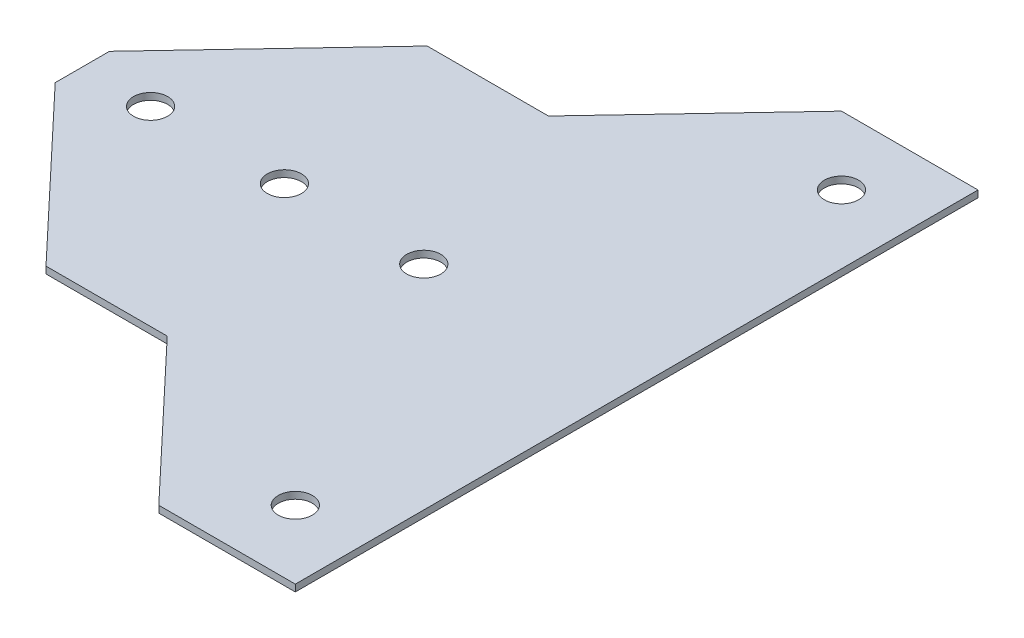
ISO-10303-21;
HEADER;
FILE_DESCRIPTION(('STEP AP214'),'2;1');
FILE_NAME('part.step','',(''),(''),'','','');
FILE_SCHEMA(('AUTOMOTIVE_DESIGN { 1 0 10303 214 1 1 1 1 }'));
ENDSEC;
DATA;
#1=APPLICATION_CONTEXT('core data for automotive mechanical design processes');
#2=APPLICATION_PROTOCOL_DEFINITION('international standard','automotive_design',2000,#1);
#3=PRODUCT_CONTEXT('',#1,'mechanical');
#4=PRODUCT('Part','Part','',(#3));
#5=PRODUCT_RELATED_PRODUCT_CATEGORY('part','',(#4));
#6=PRODUCT_DEFINITION_FORMATION('','',#4);
#7=PRODUCT_DEFINITION_CONTEXT('part definition',#1,'design');
#8=PRODUCT_DEFINITION('design','',#6,#7);
#9=PRODUCT_DEFINITION_SHAPE('','',#8);
#10=(LENGTH_UNIT() NAMED_UNIT(*) SI_UNIT(.MILLI.,.METRE.));
#11=(NAMED_UNIT(*) PLANE_ANGLE_UNIT() SI_UNIT($,.RADIAN.));
#12=(NAMED_UNIT(*) SI_UNIT($,.STERADIAN.) SOLID_ANGLE_UNIT());
#13=UNCERTAINTY_MEASURE_WITH_UNIT(LENGTH_MEASURE(1.E-05),#10,'distance_accuracy_value','');
#14=(GEOMETRIC_REPRESENTATION_CONTEXT(3) GLOBAL_UNCERTAINTY_ASSIGNED_CONTEXT((#13)) GLOBAL_UNIT_ASSIGNED_CONTEXT((#10,
#11,#12)) REPRESENTATION_CONTEXT('',''));
#15=CARTESIAN_POINT('',(0.,0.,0.));
#16=DIRECTION('',(0.,0.,1.));
#17=DIRECTION('',(1.,0.,0.));
#18=AXIS2_PLACEMENT_3D('',#15,#16,#17);
#19=CARTESIAN_POINT('',(0.,1.,0.));
#20=DIRECTION('',(0.,1.,0.));
#21=DIRECTION('',(0.,0.,1.));
#22=AXIS2_PLACEMENT_3D('',#19,#20,#21);
#23=PLANE('',#22);
#24=CARTESIAN_POINT('',(9.41999999999998,1.,0.));
#25=DIRECTION('',(0.,1.,0.));
#26=DIRECTION('',(0.,0.,1.));
#27=AXIS2_PLACEMENT_3D('',#24,#25,#26);
#28=CIRCLE('',#27,2.49999999999999);
#29=CARTESIAN_POINT('',(9.41999999999998,1.,2.49999999999999));
#30=VERTEX_POINT('',#29);
#31=EDGE_CURVE('E228',#30,#30,#28,.T.);
#32=ORIENTED_EDGE('',*,*,#31,.F.);
#33=EDGE_LOOP('',(#32));
#34=FACE_BOUND('',#33,.T.);
#35=CARTESIAN_POINT('',(30.6,1.,-40.));
#36=DIRECTION('',(0.,1.,0.));
#37=DIRECTION('',(0.,0.,1.));
#38=AXIS2_PLACEMENT_3D('',#35,#36,#37);
#39=CIRCLE('',#38,2.5);
#40=CARTESIAN_POINT('',(30.6,1.,-37.5));
#41=VERTEX_POINT('',#40);
#42=EDGE_CURVE('E216',#41,#41,#39,.T.);
#43=ORIENTED_EDGE('',*,*,#42,.F.);
#44=EDGE_LOOP('',(#43));
#45=FACE_BOUND('',#44,.T.);
#46=DIRECTION('',(-1.,0.,0.));
#47=VECTOR('',#46,1.);
#48=CARTESIAN_POINT('',(-0.238673256761059,1.,-27.92));
#49=LINE('',#48,#47);
#50=CARTESIAN_POINT('',(-0.238673256761059,1.,-27.92));
#51=VERTEX_POINT('',#50);
#52=CARTESIAN_POINT('',(-18.,1.,-27.92));
#53=VERTEX_POINT('',#52);
#54=EDGE_CURVE('E165',#51,#53,#49,.T.);
#55=ORIENTED_EDGE('',*,*,#54,.T.);
#56=DIRECTION('',(-0.686368274648378,0.,0.727254145093866));
#57=VECTOR('',#56,1.);
#58=CARTESIAN_POINT('',(-18.,1.,-27.92));
#59=LINE('',#58,#57);
#60=CARTESIAN_POINT('',(-40.6,1.,-3.97375381380878));
#61=VERTEX_POINT('',#60);
#62=EDGE_CURVE('E103',#53,#61,#59,.T.);
#63=ORIENTED_EDGE('',*,*,#62,.T.);
#64=DIRECTION('',(0.,0.,1.));
#65=VECTOR('',#64,1.);
#66=CARTESIAN_POINT('',(-40.6,1.,-3.97375381380878));
#67=LINE('',#66,#65);
#68=CARTESIAN_POINT('',(-40.6,1.,3.9737538138088));
#69=VERTEX_POINT('',#68);
#70=EDGE_CURVE('E186',#61,#69,#67,.T.);
#71=ORIENTED_EDGE('',*,*,#70,.T.);
#72=DIRECTION('',(0.686368274648378,0.,0.727254145093865));
#73=VECTOR('',#72,1.);
#74=CARTESIAN_POINT('',(-18.,1.,27.92));
#75=LINE('',#74,#73);
#76=CARTESIAN_POINT('',(-18.,1.,27.92));
#77=VERTEX_POINT('',#76);
#78=EDGE_CURVE('E205',#69,#77,#75,.T.);
#79=ORIENTED_EDGE('',*,*,#78,.T.);
#80=DIRECTION('',(1.,0.,0.));
#81=VECTOR('',#80,1.);
#82=CARTESIAN_POINT('',(-0.238673256761052,1.,27.92));
#83=LINE('',#82,#81);
#84=CARTESIAN_POINT('',(-0.238673256761052,1.,27.92));
#85=VERTEX_POINT('',#84);
#86=EDGE_CURVE('E202',#77,#85,#83,.T.);
#87=ORIENTED_EDGE('',*,*,#86,.T.);
#88=DIRECTION('',(0.686368274648378,0.,0.727254145093866));
#89=VECTOR('',#88,1.);
#90=CARTESIAN_POINT('',(20.6,1.,50.));
#91=LINE('',#90,#89);
#92=CARTESIAN_POINT('',(20.6,1.,50.));
#93=VERTEX_POINT('',#92);
#94=EDGE_CURVE('E204',#85,#93,#91,.T.);
#95=ORIENTED_EDGE('',*,*,#94,.T.);
#96=DIRECTION('',(1.,0.,0.));
#97=VECTOR('',#96,1.);
#98=CARTESIAN_POINT('',(20.6,1.,50.));
#99=LINE('',#98,#97);
#100=CARTESIAN_POINT('',(40.6,1.,50.));
#101=VERTEX_POINT('',#100);
#102=EDGE_CURVE('E128',#93,#101,#99,.T.);
#103=ORIENTED_EDGE('',*,*,#102,.T.);
#104=DIRECTION('',(0.,0.,-1.));
#105=VECTOR('',#104,1.);
#106=CARTESIAN_POINT('',(40.6,1.,-50.));
#107=LINE('',#106,#105);
#108=CARTESIAN_POINT('',(40.6,1.,-50.));
#109=VERTEX_POINT('',#108);
#110=EDGE_CURVE('E122',#101,#109,#107,.T.);
#111=ORIENTED_EDGE('',*,*,#110,.T.);
#112=DIRECTION('',(-1.,0.,0.));
#113=VECTOR('',#112,1.);
#114=CARTESIAN_POINT('',(20.6,1.,-50.));
#115=LINE('',#114,#113);
#116=CARTESIAN_POINT('',(20.6,1.,-50.));
#117=VERTEX_POINT('',#116);
#118=EDGE_CURVE('E126',#109,#117,#115,.T.);
#119=ORIENTED_EDGE('',*,*,#118,.T.);
#120=DIRECTION('',(-0.686368274648377,0.,0.727254145093866));
#121=VECTOR('',#120,1.);
#122=CARTESIAN_POINT('',(20.6,1.,-50.));
#123=LINE('',#122,#121);
#124=EDGE_CURVE('E54',#117,#51,#123,.T.);
#125=ORIENTED_EDGE('',*,*,#124,.T.);
#126=EDGE_LOOP('',(#55,#63,#71,#79,#87,#95,#103,#111,#119,#125));
#127=FACE_BOUND('',#126,.T.);
#128=CARTESIAN_POINT('',(-30.6,1.,0.));
#129=DIRECTION('',(0.,1.,0.));
#130=DIRECTION('',(0.,0.,1.));
#131=AXIS2_PLACEMENT_3D('',#128,#129,#130);
#132=CIRCLE('',#131,2.5);
#133=CARTESIAN_POINT('',(-30.6,1.,2.5));
#134=VERTEX_POINT('',#133);
#135=EDGE_CURVE('E150',#134,#134,#132,.T.);
#136=ORIENTED_EDGE('',*,*,#135,.F.);
#137=EDGE_LOOP('',(#136));
#138=FACE_BOUND('',#137,.T.);
#139=CARTESIAN_POINT('',(30.6,1.,40.));
#140=DIRECTION('',(0.,1.,0.));
#141=DIRECTION('',(0.,0.,1.));
#142=AXIS2_PLACEMENT_3D('',#139,#140,#141);
#143=CIRCLE('',#142,2.5);
#144=CARTESIAN_POINT('',(30.6,1.,42.5));
#145=VERTEX_POINT('',#144);
#146=EDGE_CURVE('E222',#145,#145,#143,.T.);
#147=ORIENTED_EDGE('',*,*,#146,.F.);
#148=EDGE_LOOP('',(#147));
#149=FACE_BOUND('',#148,.T.);
#150=CARTESIAN_POINT('',(-11.,1.,0.));
#151=DIRECTION('',(0.,1.,0.));
#152=DIRECTION('',(0.,0.,-1.));
#153=AXIS2_PLACEMENT_3D('',#150,#151,#152);
#154=CIRCLE('',#153,2.50000000000001);
#155=CARTESIAN_POINT('',(-11.,1.,-2.50000000000001));
#156=VERTEX_POINT('',#155);
#157=EDGE_CURVE('E234',#156,#156,#154,.T.);
#158=ORIENTED_EDGE('',*,*,#157,.F.);
#159=EDGE_LOOP('',(#158));
#160=FACE_BOUND('',#159,.T.);
#161=ADVANCED_FACE('F37',(#34,#45,#127,#138,#149,#160),#23,.T.);
#162=CARTESIAN_POINT('',(0.,0.,0.));
#163=DIRECTION('',(0.,1.,0.));
#164=DIRECTION('',(0.,0.,1.));
#165=AXIS2_PLACEMENT_3D('',#162,#163,#164);
#166=PLANE('',#165);
#167=DIRECTION('',(-1.,0.,0.));
#168=VECTOR('',#167,1.);
#169=CARTESIAN_POINT('',(-0.238673256761059,0.,-27.92));
#170=LINE('',#169,#168);
#171=CARTESIAN_POINT('',(-0.238673256761059,0.,-27.92));
#172=VERTEX_POINT('',#171);
#173=CARTESIAN_POINT('',(-18.,0.,-27.92));
#174=VERTEX_POINT('',#173);
#175=EDGE_CURVE('E146',#172,#174,#170,.T.);
#176=ORIENTED_EDGE('',*,*,#175,.F.);
#177=DIRECTION('',(-0.686368274648377,0.,0.727254145093866));
#178=VECTOR('',#177,1.);
#179=CARTESIAN_POINT('',(20.6,0.,-50.));
#180=LINE('',#179,#178);
#181=CARTESIAN_POINT('',(20.6,0.,-50.));
#182=VERTEX_POINT('',#181);
#183=EDGE_CURVE('E95',#182,#172,#180,.T.);
#184=ORIENTED_EDGE('',*,*,#183,.F.);
#185=DIRECTION('',(-1.,0.,0.));
#186=VECTOR('',#185,1.);
#187=CARTESIAN_POINT('',(20.6,0.,-50.));
#188=LINE('',#187,#186);
#189=CARTESIAN_POINT('',(40.6,0.,-50.));
#190=VERTEX_POINT('',#189);
#191=EDGE_CURVE('E89',#190,#182,#188,.T.);
#192=ORIENTED_EDGE('',*,*,#191,.F.);
#193=DIRECTION('',(0.,0.,-1.));
#194=VECTOR('',#193,1.);
#195=CARTESIAN_POINT('',(40.6,0.,-50.));
#196=LINE('',#195,#194);
#197=CARTESIAN_POINT('',(40.6,0.,50.));
#198=VERTEX_POINT('',#197);
#199=EDGE_CURVE('E136',#198,#190,#196,.T.);
#200=ORIENTED_EDGE('',*,*,#199,.F.);
#201=DIRECTION('',(1.,0.,0.));
#202=VECTOR('',#201,1.);
#203=CARTESIAN_POINT('',(20.6,0.,50.));
#204=LINE('',#203,#202);
#205=CARTESIAN_POINT('',(20.6,0.,50.));
#206=VERTEX_POINT('',#205);
#207=EDGE_CURVE('E160',#206,#198,#204,.T.);
#208=ORIENTED_EDGE('',*,*,#207,.F.);
#209=DIRECTION('',(0.686368274648378,0.,0.727254145093866));
#210=VECTOR('',#209,1.);
#211=CARTESIAN_POINT('',(20.6,0.,50.));
#212=LINE('',#211,#210);
#213=CARTESIAN_POINT('',(-0.238673256761052,0.,27.92));
#214=VERTEX_POINT('',#213);
#215=EDGE_CURVE('E158',#214,#206,#212,.T.);
#216=ORIENTED_EDGE('',*,*,#215,.F.);
#217=DIRECTION('',(1.,0.,0.));
#218=VECTOR('',#217,1.);
#219=CARTESIAN_POINT('',(-0.238673256761052,0.,27.92));
#220=LINE('',#219,#218);
#221=CARTESIAN_POINT('',(-18.,0.,27.92));
#222=VERTEX_POINT('',#221);
#223=EDGE_CURVE('E156',#222,#214,#220,.T.);
#224=ORIENTED_EDGE('',*,*,#223,.F.);
#225=DIRECTION('',(0.686368274648378,0.,0.727254145093865));
#226=VECTOR('',#225,1.);
#227=CARTESIAN_POINT('',(-18.,0.,27.92));
#228=LINE('',#227,#226);
#229=CARTESIAN_POINT('',(-40.6,0.,3.9737538138088));
#230=VERTEX_POINT('',#229);
#231=EDGE_CURVE('E154',#230,#222,#228,.T.);
#232=ORIENTED_EDGE('',*,*,#231,.F.);
#233=DIRECTION('',(0.,0.,1.));
#234=VECTOR('',#233,1.);
#235=CARTESIAN_POINT('',(-40.6,0.,-3.97375381380878));
#236=LINE('',#235,#234);
#237=CARTESIAN_POINT('',(-40.6,0.,-3.97375381380878));
#238=VERTEX_POINT('',#237);
#239=EDGE_CURVE('E152',#238,#230,#236,.T.);
#240=ORIENTED_EDGE('',*,*,#239,.F.);
#241=DIRECTION('',(-0.686368274648378,0.,0.727254145093866));
#242=VECTOR('',#241,1.);
#243=CARTESIAN_POINT('',(-18.,0.,-27.92));
#244=LINE('',#243,#242);
#245=EDGE_CURVE('E149',#174,#238,#244,.T.);
#246=ORIENTED_EDGE('',*,*,#245,.F.);
#247=EDGE_LOOP('',(#176,#184,#192,#200,#208,#216,#224,#232,#240,#246));
#248=FACE_BOUND('',#247,.T.);
#249=CARTESIAN_POINT('',(-30.6,0.,0.));
#250=DIRECTION('',(0.,1.,0.));
#251=DIRECTION('',(0.,0.,1.));
#252=AXIS2_PLACEMENT_3D('',#249,#250,#251);
#253=CIRCLE('',#252,2.5);
#254=CARTESIAN_POINT('',(-30.6,0.,2.5));
#255=VERTEX_POINT('',#254);
#256=EDGE_CURVE('E213',#255,#255,#253,.T.);
#257=ORIENTED_EDGE('',*,*,#256,.T.);
#258=EDGE_LOOP('',(#257));
#259=FACE_BOUND('',#258,.T.);
#260=CARTESIAN_POINT('',(30.6,0.,-40.));
#261=DIRECTION('',(0.,1.,0.));
#262=DIRECTION('',(0.,0.,1.));
#263=AXIS2_PLACEMENT_3D('',#260,#261,#262);
#264=CIRCLE('',#263,2.5);
#265=CARTESIAN_POINT('',(30.6,0.,-37.5));
#266=VERTEX_POINT('',#265);
#267=EDGE_CURVE('E219',#266,#266,#264,.T.);
#268=ORIENTED_EDGE('',*,*,#267,.T.);
#269=EDGE_LOOP('',(#268));
#270=FACE_BOUND('',#269,.T.);
#271=CARTESIAN_POINT('',(30.6,0.,40.));
#272=DIRECTION('',(0.,1.,0.));
#273=DIRECTION('',(0.,0.,1.));
#274=AXIS2_PLACEMENT_3D('',#271,#272,#273);
#275=CIRCLE('',#274,2.5);
#276=CARTESIAN_POINT('',(30.6,0.,42.5));
#277=VERTEX_POINT('',#276);
#278=EDGE_CURVE('E225',#277,#277,#275,.T.);
#279=ORIENTED_EDGE('',*,*,#278,.T.);
#280=EDGE_LOOP('',(#279));
#281=FACE_BOUND('',#280,.T.);
#282=CARTESIAN_POINT('',(9.41999999999998,0.,0.));
#283=DIRECTION('',(0.,1.,0.));
#284=DIRECTION('',(0.,0.,1.));
#285=AXIS2_PLACEMENT_3D('',#282,#283,#284);
#286=CIRCLE('',#285,2.49999999999999);
#287=CARTESIAN_POINT('',(9.41999999999998,0.,2.49999999999999));
#288=VERTEX_POINT('',#287);
#289=EDGE_CURVE('E231',#288,#288,#286,.T.);
#290=ORIENTED_EDGE('',*,*,#289,.T.);
#291=EDGE_LOOP('',(#290));
#292=FACE_BOUND('',#291,.T.);
#293=CARTESIAN_POINT('',(-11.,0.,0.));
#294=DIRECTION('',(0.,1.,0.));
#295=DIRECTION('',(0.,0.,-1.));
#296=AXIS2_PLACEMENT_3D('',#293,#294,#295);
#297=CIRCLE('',#296,2.50000000000001);
#298=CARTESIAN_POINT('',(-11.,0.,-2.50000000000001));
#299=VERTEX_POINT('',#298);
#300=EDGE_CURVE('E237',#299,#299,#297,.T.);
#301=ORIENTED_EDGE('',*,*,#300,.T.);
#302=EDGE_LOOP('',(#301));
#303=FACE_BOUND('',#302,.T.);
#304=ADVANCED_FACE('F190',(#248,#259,#270,#281,#292,#303),#166,.F.);
#305=CARTESIAN_POINT('',(-0.238673256761059,1.,-27.92));
#306=DIRECTION('',(0.,0.,1.));
#307=DIRECTION('',(1.,0.,0.));
#308=AXIS2_PLACEMENT_3D('',#305,#306,#307);
#309=PLANE('',#308);
#310=ORIENTED_EDGE('',*,*,#175,.T.);
#311=DIRECTION('',(0.,-1.,0.));
#312=VECTOR('',#311,1.);
#313=CARTESIAN_POINT('',(-18.,1.,-27.92));
#314=LINE('',#313,#312);
#315=EDGE_CURVE('E11',#53,#174,#314,.T.);
#316=ORIENTED_EDGE('',*,*,#315,.F.);
#317=ORIENTED_EDGE('',*,*,#54,.F.);
#318=DIRECTION('',(0.,-1.,0.));
#319=VECTOR('',#318,1.);
#320=CARTESIAN_POINT('',(-0.238673256761059,1.,-27.92));
#321=LINE('',#320,#319);
#322=EDGE_CURVE('E142',#51,#172,#321,.T.);
#323=ORIENTED_EDGE('',*,*,#322,.T.);
#324=EDGE_LOOP('',(#310,#316,#317,#323));
#325=FACE_BOUND('',#324,.T.);
#326=ADVANCED_FACE('F39',(#325),#309,.F.);
#327=CARTESIAN_POINT('',(-18.,1.,-27.92));
#328=DIRECTION('',(0.727254145093866,0.,0.686368274648378));
#329=DIRECTION('',(0.686368274648378,0.,-0.727254145093866));
#330=AXIS2_PLACEMENT_3D('',#327,#328,#329);
#331=PLANE('',#330);
#332=ORIENTED_EDGE('',*,*,#245,.T.);
#333=DIRECTION('',(0.,-1.,0.));
#334=VECTOR('',#333,1.);
#335=CARTESIAN_POINT('',(-40.6,1.,-3.97375381380878));
#336=LINE('',#335,#334);
#337=EDGE_CURVE('E46',#61,#238,#336,.T.);
#338=ORIENTED_EDGE('',*,*,#337,.F.);
#339=ORIENTED_EDGE('',*,*,#62,.F.);
#340=ORIENTED_EDGE('',*,*,#315,.T.);
#341=EDGE_LOOP('',(#332,#338,#339,#340));
#342=FACE_BOUND('',#341,.T.);
#343=ADVANCED_FACE('F279',(#342),#331,.F.);
#344=CARTESIAN_POINT('',(-40.6,1.,-3.97375381380878));
#345=DIRECTION('',(1.,0.,0.));
#346=DIRECTION('',(0.,0.,-1.));
#347=AXIS2_PLACEMENT_3D('',#344,#345,#346);
#348=PLANE('',#347);
#349=ORIENTED_EDGE('',*,*,#239,.T.);
#350=DIRECTION('',(0.,-1.,0.));
#351=VECTOR('',#350,1.);
#352=CARTESIAN_POINT('',(-40.6,1.,3.9737538138088));
#353=LINE('',#352,#351);
#354=EDGE_CURVE('E178',#69,#230,#353,.T.);
#355=ORIENTED_EDGE('',*,*,#354,.F.);
#356=ORIENTED_EDGE('',*,*,#70,.F.);
#357=ORIENTED_EDGE('',*,*,#337,.T.);
#358=EDGE_LOOP('',(#349,#355,#356,#357));
#359=FACE_BOUND('',#358,.T.);
#360=ADVANCED_FACE('F184',(#359),#348,.F.);
#361=CARTESIAN_POINT('',(-18.,1.,27.92));
#362=DIRECTION('',(0.727254145093865,0.,-0.686368274648378));
#363=DIRECTION('',(-0.686368274648378,0.,-0.727254145093865));
#364=AXIS2_PLACEMENT_3D('',#361,#362,#363);
#365=PLANE('',#364);
#366=ORIENTED_EDGE('',*,*,#231,.T.);
#367=DIRECTION('',(0.,-1.,0.));
#368=VECTOR('',#367,1.);
#369=CARTESIAN_POINT('',(-18.,1.,27.92));
#370=LINE('',#369,#368);
#371=EDGE_CURVE('E175',#77,#222,#370,.T.);
#372=ORIENTED_EDGE('',*,*,#371,.F.);
#373=ORIENTED_EDGE('',*,*,#78,.F.);
#374=ORIENTED_EDGE('',*,*,#354,.T.);
#375=EDGE_LOOP('',(#366,#372,#373,#374));
#376=FACE_BOUND('',#375,.T.);
#377=ADVANCED_FACE('F196',(#376),#365,.F.);
#378=CARTESIAN_POINT('',(-0.238673256761052,1.,27.92));
#379=DIRECTION('',(0.,0.,-1.));
#380=DIRECTION('',(-1.,0.,0.));
#381=AXIS2_PLACEMENT_3D('',#378,#379,#380);
#382=PLANE('',#381);
#383=ORIENTED_EDGE('',*,*,#223,.T.);
#384=DIRECTION('',(0.,-1.,0.));
#385=VECTOR('',#384,1.);
#386=CARTESIAN_POINT('',(-0.238673256761052,1.,27.92));
#387=LINE('',#386,#385);
#388=EDGE_CURVE('E172',#85,#214,#387,.T.);
#389=ORIENTED_EDGE('',*,*,#388,.F.);
#390=ORIENTED_EDGE('',*,*,#86,.F.);
#391=ORIENTED_EDGE('',*,*,#371,.T.);
#392=EDGE_LOOP('',(#383,#389,#390,#391));
#393=FACE_BOUND('',#392,.T.);
#394=ADVANCED_FACE('F200',(#393),#382,.F.);
#395=CARTESIAN_POINT('',(20.6,1.,50.));
#396=DIRECTION('',(0.727254145093866,0.,-0.686368274648378));
#397=DIRECTION('',(-0.686368274648378,0.,-0.727254145093866));
#398=AXIS2_PLACEMENT_3D('',#395,#396,#397);
#399=PLANE('',#398);
#400=ORIENTED_EDGE('',*,*,#215,.T.);
#401=DIRECTION('',(0.,-1.,0.));
#402=VECTOR('',#401,1.);
#403=CARTESIAN_POINT('',(20.6,1.,50.));
#404=LINE('',#403,#402);
#405=EDGE_CURVE('E169',#93,#206,#404,.T.);
#406=ORIENTED_EDGE('',*,*,#405,.F.);
#407=ORIENTED_EDGE('',*,*,#94,.F.);
#408=ORIENTED_EDGE('',*,*,#388,.T.);
#409=EDGE_LOOP('',(#400,#406,#407,#408));
#410=FACE_BOUND('',#409,.T.);
#411=ADVANCED_FACE('F269',(#410),#399,.F.);
#412=CARTESIAN_POINT('',(20.6,1.,50.));
#413=DIRECTION('',(0.,0.,-1.));
#414=DIRECTION('',(-1.,0.,0.));
#415=AXIS2_PLACEMENT_3D('',#412,#413,#414);
#416=PLANE('',#415);
#417=ORIENTED_EDGE('',*,*,#207,.T.);
#418=DIRECTION('',(0.,-1.,0.));
#419=VECTOR('',#418,1.);
#420=CARTESIAN_POINT('',(40.6,1.,50.));
#421=LINE('',#420,#419);
#422=EDGE_CURVE('E137',#101,#198,#421,.T.);
#423=ORIENTED_EDGE('',*,*,#422,.F.);
#424=ORIENTED_EDGE('',*,*,#102,.F.);
#425=ORIENTED_EDGE('',*,*,#405,.T.);
#426=EDGE_LOOP('',(#417,#423,#424,#425));
#427=FACE_BOUND('',#426,.T.);
#428=ADVANCED_FACE('F266',(#427),#416,.F.);
#429=CARTESIAN_POINT('',(40.6,1.,-50.));
#430=DIRECTION('',(-1.,0.,0.));
#431=DIRECTION('',(0.,0.,1.));
#432=AXIS2_PLACEMENT_3D('',#429,#430,#431);
#433=PLANE('',#432);
#434=ORIENTED_EDGE('',*,*,#199,.T.);
#435=DIRECTION('',(0.,-1.,0.));
#436=VECTOR('',#435,1.);
#437=CARTESIAN_POINT('',(40.6,1.,-50.));
#438=LINE('',#437,#436);
#439=EDGE_CURVE('E133',#109,#190,#438,.T.);
#440=ORIENTED_EDGE('',*,*,#439,.F.);
#441=ORIENTED_EDGE('',*,*,#110,.F.);
#442=ORIENTED_EDGE('',*,*,#422,.T.);
#443=EDGE_LOOP('',(#434,#440,#441,#442));
#444=FACE_BOUND('',#443,.T.);
#445=ADVANCED_FACE('F134',(#444),#433,.F.);
#446=CARTESIAN_POINT('',(20.6,1.,-50.));
#447=DIRECTION('',(0.,0.,1.));
#448=DIRECTION('',(1.,0.,0.));
#449=AXIS2_PLACEMENT_3D('',#446,#447,#448);
#450=PLANE('',#449);
#451=ORIENTED_EDGE('',*,*,#191,.T.);
#452=DIRECTION('',(0.,-1.,0.));
#453=VECTOR('',#452,1.);
#454=CARTESIAN_POINT('',(20.6,1.,-50.));
#455=LINE('',#454,#453);
#456=EDGE_CURVE('E138',#117,#182,#455,.T.);
#457=ORIENTED_EDGE('',*,*,#456,.F.);
#458=ORIENTED_EDGE('',*,*,#118,.F.);
#459=ORIENTED_EDGE('',*,*,#439,.T.);
#460=EDGE_LOOP('',(#451,#457,#458,#459));
#461=FACE_BOUND('',#460,.T.);
#462=ADVANCED_FACE('F140',(#461),#450,.F.);
#463=CARTESIAN_POINT('',(20.6,1.,-50.));
#464=DIRECTION('',(0.727254145093866,0.,0.686368274648377));
#465=DIRECTION('',(0.686368274648377,0.,-0.727254145093866));
#466=AXIS2_PLACEMENT_3D('',#463,#464,#465);
#467=PLANE('',#466);
#468=ORIENTED_EDGE('',*,*,#183,.T.);
#469=ORIENTED_EDGE('',*,*,#322,.F.);
#470=ORIENTED_EDGE('',*,*,#124,.F.);
#471=ORIENTED_EDGE('',*,*,#456,.T.);
#472=EDGE_LOOP('',(#468,#469,#470,#471));
#473=FACE_BOUND('',#472,.T.);
#474=ADVANCED_FACE('F259',(#473),#467,.F.);
#475=CARTESIAN_POINT('',(-30.6,1.,0.));
#476=DIRECTION('',(0.,-1.,0.));
#477=DIRECTION('',(0.,0.,-1.));
#478=AXIS2_PLACEMENT_3D('',#475,#476,#477);
#479=CYLINDRICAL_SURFACE('',#478,2.5);
#480=ORIENTED_EDGE('',*,*,#135,.T.);
#481=EDGE_LOOP('',(#480));
#482=FACE_BOUND('',#481,.T.);
#483=ORIENTED_EDGE('',*,*,#256,.F.);
#484=EDGE_LOOP('',(#483));
#485=FACE_BOUND('',#484,.T.);
#486=ADVANCED_FACE('F256',(#482,#485),#479,.F.);
#487=CARTESIAN_POINT('',(30.6,1.,-40.));
#488=DIRECTION('',(0.,-1.,0.));
#489=DIRECTION('',(0.,0.,-1.));
#490=AXIS2_PLACEMENT_3D('',#487,#488,#489);
#491=CYLINDRICAL_SURFACE('',#490,2.5);
#492=ORIENTED_EDGE('',*,*,#42,.T.);
#493=EDGE_LOOP('',(#492));
#494=FACE_BOUND('',#493,.T.);
#495=ORIENTED_EDGE('',*,*,#267,.F.);
#496=EDGE_LOOP('',(#495));
#497=FACE_BOUND('',#496,.T.);
#498=ADVANCED_FACE('F369',(#494,#497),#491,.F.);
#499=CARTESIAN_POINT('',(30.6,1.,40.));
#500=DIRECTION('',(0.,-1.,0.));
#501=DIRECTION('',(0.,0.,-1.));
#502=AXIS2_PLACEMENT_3D('',#499,#500,#501);
#503=CYLINDRICAL_SURFACE('',#502,2.5);
#504=ORIENTED_EDGE('',*,*,#146,.T.);
#505=EDGE_LOOP('',(#504));
#506=FACE_BOUND('',#505,.T.);
#507=ORIENTED_EDGE('',*,*,#278,.F.);
#508=EDGE_LOOP('',(#507));
#509=FACE_BOUND('',#508,.T.);
#510=ADVANCED_FACE('F378',(#506,#509),#503,.F.);
#511=CARTESIAN_POINT('',(9.41999999999998,1.,0.));
#512=DIRECTION('',(0.,-1.,0.));
#513=DIRECTION('',(0.,0.,-1.));
#514=AXIS2_PLACEMENT_3D('',#511,#512,#513);
#515=CYLINDRICAL_SURFACE('',#514,2.49999999999999);
#516=ORIENTED_EDGE('',*,*,#31,.T.);
#517=EDGE_LOOP('',(#516));
#518=FACE_BOUND('',#517,.T.);
#519=ORIENTED_EDGE('',*,*,#289,.F.);
#520=EDGE_LOOP('',(#519));
#521=FACE_BOUND('',#520,.T.);
#522=ADVANCED_FACE('F387',(#518,#521),#515,.F.);
#523=CARTESIAN_POINT('',(-11.,1.,0.));
#524=DIRECTION('',(0.,-1.,0.));
#525=DIRECTION('',(0.,0.,-1.));
#526=AXIS2_PLACEMENT_3D('',#523,#524,#525);
#527=CYLINDRICAL_SURFACE('',#526,2.50000000000001);
#528=ORIENTED_EDGE('',*,*,#157,.T.);
#529=EDGE_LOOP('',(#528));
#530=FACE_BOUND('',#529,.T.);
#531=ORIENTED_EDGE('',*,*,#300,.F.);
#532=EDGE_LOOP('',(#531));
#533=FACE_BOUND('',#532,.T.);
#534=ADVANCED_FACE('F243',(#530,#533),#527,.F.);
#535=CLOSED_SHELL('',(#161,#304,#326,#343,#360,#377,#394,#411,#428,#445,#462,#474,#486,#498,
#510,#522,#534));
#536=MANIFOLD_SOLID_BREP('B2',#535);
#537=ADVANCED_BREP_SHAPE_REPRESENTATION('',(#18,#536),#14);
#538=SHAPE_DEFINITION_REPRESENTATION(#9,#537);
ENDSEC;
END-ISO-10303-21;
